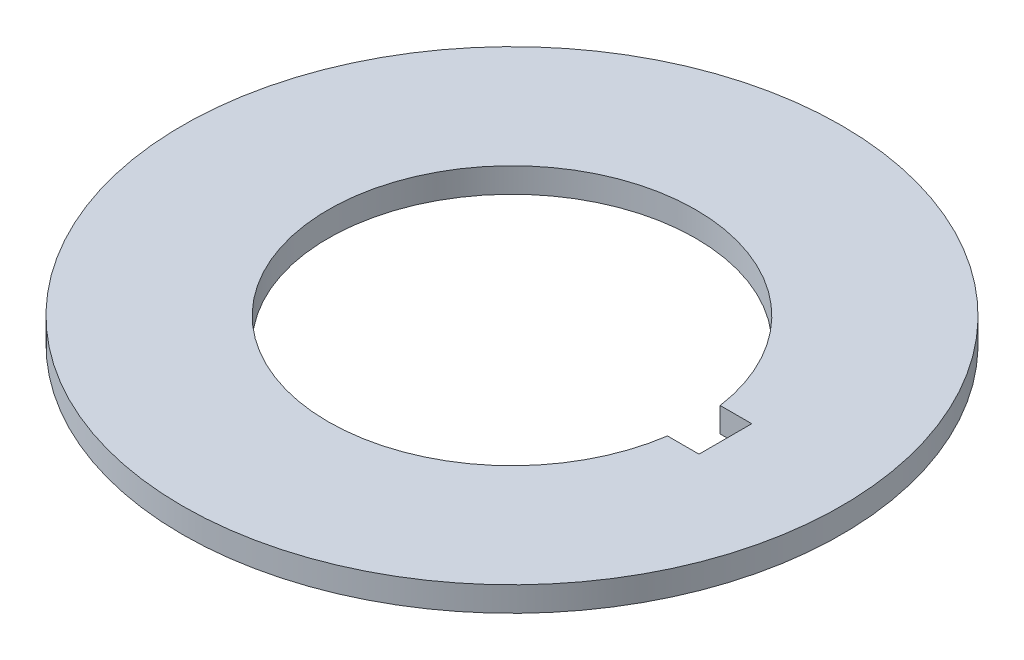
ISO-10303-21;
HEADER;
FILE_DESCRIPTION(('STEP AP214'),'2;1');
FILE_NAME('part.step','',(''),(''),'','','');
FILE_SCHEMA(('AUTOMOTIVE_DESIGN { 1 0 10303 214 1 1 1 1 }'));
ENDSEC;
DATA;
#1=APPLICATION_CONTEXT('core data for automotive mechanical design processes');
#2=APPLICATION_PROTOCOL_DEFINITION('international standard','automotive_design',2000,#1);
#3=PRODUCT_CONTEXT('',#1,'mechanical');
#4=PRODUCT('Part','Part','',(#3));
#5=PRODUCT_RELATED_PRODUCT_CATEGORY('part','',(#4));
#6=PRODUCT_DEFINITION_FORMATION('','',#4);
#7=PRODUCT_DEFINITION_CONTEXT('part definition',#1,'design');
#8=PRODUCT_DEFINITION('design','',#6,#7);
#9=PRODUCT_DEFINITION_SHAPE('','',#8);
#10=(LENGTH_UNIT() NAMED_UNIT(*) SI_UNIT(.MILLI.,.METRE.));
#11=(NAMED_UNIT(*) PLANE_ANGLE_UNIT() SI_UNIT($,.RADIAN.));
#12=(NAMED_UNIT(*) SI_UNIT($,.STERADIAN.) SOLID_ANGLE_UNIT());
#13=UNCERTAINTY_MEASURE_WITH_UNIT(LENGTH_MEASURE(1.E-05),#10,'distance_accuracy_value','');
#14=(GEOMETRIC_REPRESENTATION_CONTEXT(3) GLOBAL_UNCERTAINTY_ASSIGNED_CONTEXT((#13)) GLOBAL_UNIT_ASSIGNED_CONTEXT((#10,
#11,#12)) REPRESENTATION_CONTEXT('',''));
#15=CARTESIAN_POINT('',(0.,0.,0.));
#16=DIRECTION('',(0.,0.,1.));
#17=DIRECTION('',(1.,0.,0.));
#18=AXIS2_PLACEMENT_3D('',#15,#16,#17);
#19=CARTESIAN_POINT('',(0.,1.5,0.));
#20=DIRECTION('',(0.,1.,0.));
#21=DIRECTION('',(0.,0.,1.));
#22=AXIS2_PLACEMENT_3D('',#19,#20,#21);
#23=PLANE('',#22);
#24=CARTESIAN_POINT('',(0.,1.5,0.));
#25=DIRECTION('',(0.,1.,0.));
#26=DIRECTION('',(0.,0.,1.));
#27=AXIS2_PLACEMENT_3D('',#24,#25,#26);
#28=CIRCLE('',#27,20.);
#29=CARTESIAN_POINT('',(0.,1.5,20.));
#30=VERTEX_POINT('',#29);
#31=EDGE_CURVE('E11',#30,#30,#28,.T.);
#32=ORIENTED_EDGE('',*,*,#31,.T.);
#33=EDGE_LOOP('',(#32));
#34=FACE_BOUND('',#33,.T.);
#35=DIRECTION('',(1.,0.,0.));
#36=VECTOR('',#35,1.);
#37=CARTESIAN_POINT('',(12.95,1.5,1.6));
#38=LINE('',#37,#36);
#39=CARTESIAN_POINT('',(11.034604659887,1.5,1.6));
#40=VERTEX_POINT('',#39);
#41=CARTESIAN_POINT('',(12.95,1.5,1.6));
#42=VERTEX_POINT('',#41);
#43=EDGE_CURVE('E94',#40,#42,#38,.T.);
#44=ORIENTED_EDGE('',*,*,#43,.F.);
#45=CARTESIAN_POINT('',(0.,1.5,0.));
#46=DIRECTION('',(0.,1.,0.));
#47=DIRECTION('',(0.,0.,1.));
#48=AXIS2_PLACEMENT_3D('',#45,#46,#47);
#49=CIRCLE('',#48,11.15);
#50=CARTESIAN_POINT('',(11.034604659887,1.5,-1.6));
#51=VERTEX_POINT('',#50);
#52=EDGE_CURVE('E85',#51,#40,#49,.T.);
#53=ORIENTED_EDGE('',*,*,#52,.F.);
#54=DIRECTION('',(-1.,0.,0.));
#55=VECTOR('',#54,1.);
#56=CARTESIAN_POINT('',(11.034604659887,1.5,-1.6));
#57=LINE('',#56,#55);
#58=CARTESIAN_POINT('',(12.95,1.5,-1.6));
#59=VERTEX_POINT('',#58);
#60=EDGE_CURVE('E110',#59,#51,#57,.T.);
#61=ORIENTED_EDGE('',*,*,#60,.F.);
#62=DIRECTION('',(0.,0.,-1.));
#63=VECTOR('',#62,1.);
#64=CARTESIAN_POINT('',(12.95,1.5,-1.6));
#65=LINE('',#64,#63);
#66=EDGE_CURVE('E106',#42,#59,#65,.T.);
#67=ORIENTED_EDGE('',*,*,#66,.F.);
#68=EDGE_LOOP('',(#44,#53,#61,#67));
#69=FACE_BOUND('',#68,.T.);
#70=ADVANCED_FACE('F43',(#34,#69),#23,.T.);
#71=CARTESIAN_POINT('',(0.,0.,0.));
#72=DIRECTION('',(0.,1.,0.));
#73=DIRECTION('',(0.,0.,1.));
#74=AXIS2_PLACEMENT_3D('',#71,#72,#73);
#75=PLANE('',#74);
#76=CARTESIAN_POINT('',(0.,0.,0.));
#77=DIRECTION('',(0.,1.,0.));
#78=DIRECTION('',(0.,0.,1.));
#79=AXIS2_PLACEMENT_3D('',#76,#77,#78);
#80=CIRCLE('',#79,20.);
#81=CARTESIAN_POINT('',(0.,0.,20.));
#82=VERTEX_POINT('',#81);
#83=EDGE_CURVE('E47',#82,#82,#80,.T.);
#84=ORIENTED_EDGE('',*,*,#83,.F.);
#85=EDGE_LOOP('',(#84));
#86=FACE_BOUND('',#85,.T.);
#87=CARTESIAN_POINT('',(0.,0.,0.));
#88=DIRECTION('',(0.,1.,0.));
#89=DIRECTION('',(0.,0.,1.));
#90=AXIS2_PLACEMENT_3D('',#87,#88,#89);
#91=CIRCLE('',#90,11.15);
#92=CARTESIAN_POINT('',(11.034604659887,0.,-1.6));
#93=VERTEX_POINT('',#92);
#94=CARTESIAN_POINT('',(11.034604659887,0.,1.6));
#95=VERTEX_POINT('',#94);
#96=EDGE_CURVE('E67',#93,#95,#91,.T.);
#97=ORIENTED_EDGE('',*,*,#96,.T.);
#98=DIRECTION('',(1.,0.,0.));
#99=VECTOR('',#98,1.);
#100=CARTESIAN_POINT('',(12.95,0.,1.6));
#101=LINE('',#100,#99);
#102=CARTESIAN_POINT('',(12.95,0.,1.6));
#103=VERTEX_POINT('',#102);
#104=EDGE_CURVE('E101',#95,#103,#101,.T.);
#105=ORIENTED_EDGE('',*,*,#104,.T.);
#106=DIRECTION('',(0.,0.,-1.));
#107=VECTOR('',#106,1.);
#108=CARTESIAN_POINT('',(12.95,0.,-1.6));
#109=LINE('',#108,#107);
#110=CARTESIAN_POINT('',(12.95,0.,-1.6));
#111=VERTEX_POINT('',#110);
#112=EDGE_CURVE('E119',#103,#111,#109,.T.);
#113=ORIENTED_EDGE('',*,*,#112,.T.);
#114=DIRECTION('',(-1.,0.,0.));
#115=VECTOR('',#114,1.);
#116=CARTESIAN_POINT('',(11.034604659887,0.,-1.6));
#117=LINE('',#116,#115);
#118=EDGE_CURVE('E95',#111,#93,#117,.T.);
#119=ORIENTED_EDGE('',*,*,#118,.T.);
#120=EDGE_LOOP('',(#97,#105,#113,#119));
#121=FACE_BOUND('',#120,.T.);
#122=ADVANCED_FACE('F135',(#86,#121),#75,.F.);
#123=CARTESIAN_POINT('',(0.,1.5,0.));
#124=DIRECTION('',(0.,-1.,0.));
#125=DIRECTION('',(0.,0.,-1.));
#126=AXIS2_PLACEMENT_3D('',#123,#124,#125);
#127=CYLINDRICAL_SURFACE('',#126,20.);
#128=ORIENTED_EDGE('',*,*,#31,.F.);
#129=EDGE_LOOP('',(#128));
#130=FACE_BOUND('',#129,.T.);
#131=ORIENTED_EDGE('',*,*,#83,.T.);
#132=EDGE_LOOP('',(#131));
#133=FACE_BOUND('',#132,.T.);
#134=ADVANCED_FACE('F45',(#130,#133),#127,.T.);
#135=CARTESIAN_POINT('',(0.,1.5,0.));
#136=DIRECTION('',(0.,-1.,0.));
#137=DIRECTION('',(0.,0.,-1.));
#138=AXIS2_PLACEMENT_3D('',#135,#136,#137);
#139=CYLINDRICAL_SURFACE('',#138,11.15);
#140=ORIENTED_EDGE('',*,*,#96,.F.);
#141=DIRECTION('',(0.,-1.,0.));
#142=VECTOR('',#141,1.);
#143=CARTESIAN_POINT('',(11.034604659887,1.5,-1.6));
#144=LINE('',#143,#142);
#145=EDGE_CURVE('E89',#51,#93,#144,.T.);
#146=ORIENTED_EDGE('',*,*,#145,.F.);
#147=ORIENTED_EDGE('',*,*,#52,.T.);
#148=DIRECTION('',(0.,-1.,0.));
#149=VECTOR('',#148,1.);
#150=CARTESIAN_POINT('',(11.034604659887,1.5,1.6));
#151=LINE('',#150,#149);
#152=EDGE_CURVE('E88',#40,#95,#151,.T.);
#153=ORIENTED_EDGE('',*,*,#152,.T.);
#154=EDGE_LOOP('',(#140,#146,#147,#153));
#155=FACE_BOUND('',#154,.T.);
#156=ADVANCED_FACE('F87',(#155),#139,.F.);
#157=CARTESIAN_POINT('',(12.95,1.5,1.6));
#158=DIRECTION('',(0.,0.,-1.));
#159=DIRECTION('',(-1.,0.,0.));
#160=AXIS2_PLACEMENT_3D('',#157,#158,#159);
#161=PLANE('',#160);
#162=ORIENTED_EDGE('',*,*,#104,.F.);
#163=ORIENTED_EDGE('',*,*,#152,.F.);
#164=ORIENTED_EDGE('',*,*,#43,.T.);
#165=DIRECTION('',(0.,-1.,0.));
#166=VECTOR('',#165,1.);
#167=CARTESIAN_POINT('',(12.95,1.5,1.6));
#168=LINE('',#167,#166);
#169=EDGE_CURVE('E103',#42,#103,#168,.T.);
#170=ORIENTED_EDGE('',*,*,#169,.T.);
#171=EDGE_LOOP('',(#162,#163,#164,#170));
#172=FACE_BOUND('',#171,.T.);
#173=ADVANCED_FACE('F98',(#172),#161,.T.);
#174=CARTESIAN_POINT('',(12.95,1.5,-1.6));
#175=DIRECTION('',(-1.,0.,0.));
#176=DIRECTION('',(0.,0.,1.));
#177=AXIS2_PLACEMENT_3D('',#174,#175,#176);
#178=PLANE('',#177);
#179=ORIENTED_EDGE('',*,*,#112,.F.);
#180=ORIENTED_EDGE('',*,*,#169,.F.);
#181=ORIENTED_EDGE('',*,*,#66,.T.);
#182=DIRECTION('',(0.,-1.,0.));
#183=VECTOR('',#182,1.);
#184=CARTESIAN_POINT('',(12.95,1.5,-1.6));
#185=LINE('',#184,#183);
#186=EDGE_CURVE('E59',#59,#111,#185,.T.);
#187=ORIENTED_EDGE('',*,*,#186,.T.);
#188=EDGE_LOOP('',(#179,#180,#181,#187));
#189=FACE_BOUND('',#188,.T.);
#190=ADVANCED_FACE('F133',(#189),#178,.T.);
#191=CARTESIAN_POINT('',(11.034604659887,1.5,-1.6));
#192=DIRECTION('',(0.,0.,1.));
#193=DIRECTION('',(1.,0.,0.));
#194=AXIS2_PLACEMENT_3D('',#191,#192,#193);
#195=PLANE('',#194);
#196=ORIENTED_EDGE('',*,*,#118,.F.);
#197=ORIENTED_EDGE('',*,*,#186,.F.);
#198=ORIENTED_EDGE('',*,*,#60,.T.);
#199=ORIENTED_EDGE('',*,*,#145,.T.);
#200=EDGE_LOOP('',(#196,#197,#198,#199));
#201=FACE_BOUND('',#200,.T.);
#202=ADVANCED_FACE('F136',(#201),#195,.T.);
#203=CLOSED_SHELL('',(#70,#122,#134,#156,#173,#190,#202));
#204=MANIFOLD_SOLID_BREP('B2',#203);
#205=ADVANCED_BREP_SHAPE_REPRESENTATION('',(#18,#204),#14);
#206=SHAPE_DEFINITION_REPRESENTATION(#9,#205);
ENDSEC;
END-ISO-10303-21;
